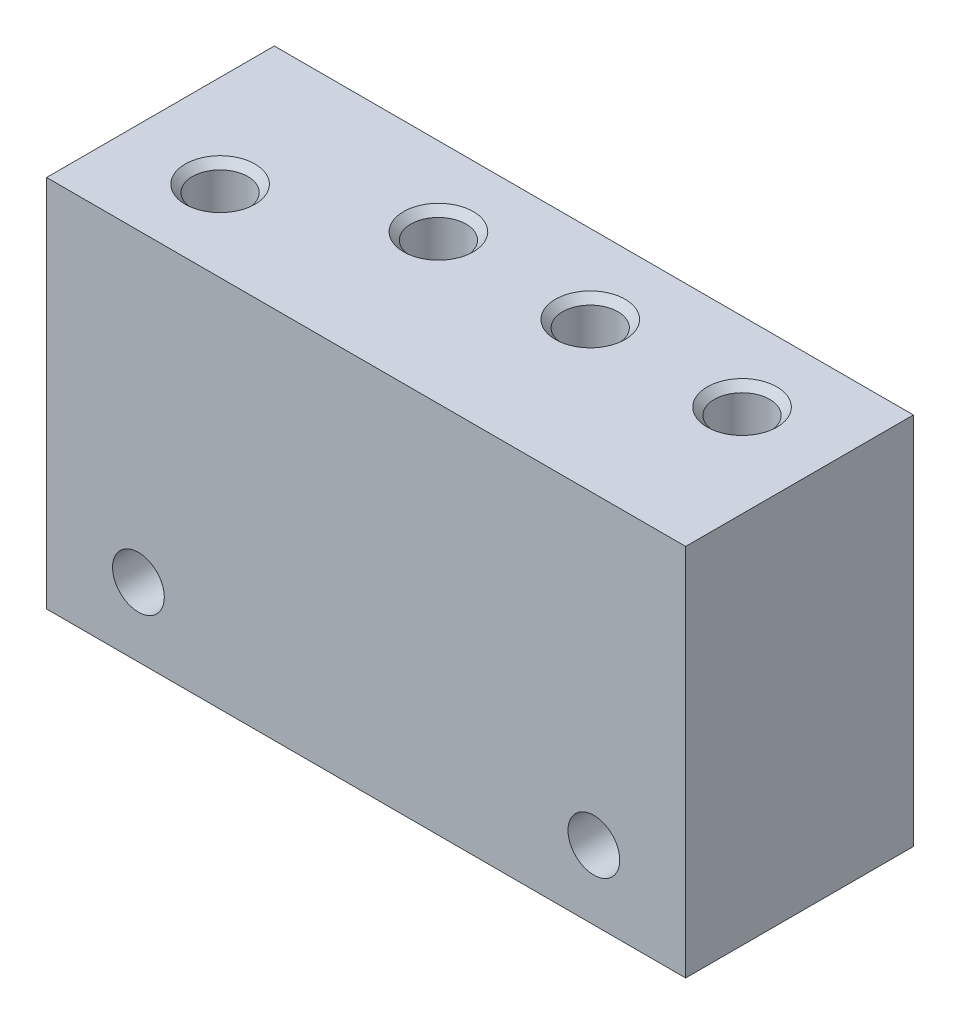
ISO-10303-21;
HEADER;
FILE_DESCRIPTION(('STEP AP214'),'2;1');
FILE_NAME('part.step','',(''),(''),'','','');
FILE_SCHEMA(('AUTOMOTIVE_DESIGN { 1 0 10303 214 1 1 1 1 }'));
ENDSEC;
DATA;
#1=APPLICATION_CONTEXT('core data for automotive mechanical design processes');
#2=APPLICATION_PROTOCOL_DEFINITION('international standard','automotive_design',2000,#1);
#3=PRODUCT_CONTEXT('',#1,'mechanical');
#4=PRODUCT('Part','Part','',(#3));
#5=PRODUCT_RELATED_PRODUCT_CATEGORY('part','',(#4));
#6=PRODUCT_DEFINITION_FORMATION('','',#4);
#7=PRODUCT_DEFINITION_CONTEXT('part definition',#1,'design');
#8=PRODUCT_DEFINITION('design','',#6,#7);
#9=PRODUCT_DEFINITION_SHAPE('','',#8);
#10=(LENGTH_UNIT() NAMED_UNIT(*) SI_UNIT(.MILLI.,.METRE.));
#11=(NAMED_UNIT(*) PLANE_ANGLE_UNIT() SI_UNIT($,.RADIAN.));
#12=(NAMED_UNIT(*) SI_UNIT($,.STERADIAN.) SOLID_ANGLE_UNIT());
#13=UNCERTAINTY_MEASURE_WITH_UNIT(LENGTH_MEASURE(1.E-05),#10,'distance_accuracy_value','');
#14=(GEOMETRIC_REPRESENTATION_CONTEXT(3) GLOBAL_UNCERTAINTY_ASSIGNED_CONTEXT((#13)) GLOBAL_UNIT_ASSIGNED_CONTEXT((#10,
#11,#12)) REPRESENTATION_CONTEXT('',''));
#15=CARTESIAN_POINT('',(0.,0.,0.));
#16=DIRECTION('',(0.,0.,1.));
#17=DIRECTION('',(1.,0.,0.));
#18=AXIS2_PLACEMENT_3D('',#15,#16,#17);
#19=CARTESIAN_POINT('',(22.1,12.925,0.));
#20=DIRECTION('',(0.,0.,-1.));
#21=DIRECTION('',(-1.,0.,0.));
#22=AXIS2_PLACEMENT_3D('',#19,#20,#21);
#23=PLANE('',#22);
#24=CARTESIAN_POINT('',(24.,17.646,0.));
#25=DIRECTION('',(0.,0.,-1.));
#26=DIRECTION('',(-1.,0.,0.));
#27=AXIS2_PLACEMENT_3D('',#24,#25,#26);
#28=CIRCLE('',#27,0.85);
#29=CARTESIAN_POINT('',(23.15,17.646,0.));
#30=VERTEX_POINT('',#29);
#31=EDGE_CURVE('E726',#30,#30,#28,.T.);
#32=ORIENTED_EDGE('',*,*,#31,.F.);
#33=EDGE_LOOP('',(#32));
#34=FACE_BOUND('',#33,.T.);
#35=CARTESIAN_POINT('',(27.3,14.246,0.));
#36=DIRECTION('',(0.,0.,-1.));
#37=DIRECTION('',(-1.,0.,0.));
#38=AXIS2_PLACEMENT_3D('',#35,#36,#37);
#39=CIRCLE('',#38,0.6);
#40=CARTESIAN_POINT('',(26.7,14.246,0.));
#41=VERTEX_POINT('',#40);
#42=EDGE_CURVE('E19',#41,#41,#39,.T.);
#43=ORIENTED_EDGE('',*,*,#42,.F.);
#44=EDGE_LOOP('',(#43));
#45=FACE_BOUND('',#44,.T.);
#46=CARTESIAN_POINT('',(27.3,19.646,0.));
#47=DIRECTION('',(0.,0.,-1.));
#48=DIRECTION('',(-1.,0.,0.));
#49=AXIS2_PLACEMENT_3D('',#46,#47,#48);
#50=CIRCLE('',#49,0.6);
#51=CARTESIAN_POINT('',(26.7,19.646,0.));
#52=VERTEX_POINT('',#51);
#53=EDGE_CURVE('E142',#52,#52,#50,.T.);
#54=ORIENTED_EDGE('',*,*,#53,.F.);
#55=EDGE_LOOP('',(#54));
#56=FACE_BOUND('',#55,.T.);
#57=CARTESIAN_POINT('',(27.3,16.946,0.));
#58=DIRECTION('',(0.,0.,-1.));
#59=DIRECTION('',(-1.,0.,0.));
#60=AXIS2_PLACEMENT_3D('',#57,#58,#59);
#61=CIRCLE('',#60,0.6);
#62=CARTESIAN_POINT('',(26.7,16.946,0.));
#63=VERTEX_POINT('',#62);
#64=EDGE_CURVE('E139',#63,#63,#61,.T.);
#65=ORIENTED_EDGE('',*,*,#64,.F.);
#66=EDGE_LOOP('',(#65));
#67=FACE_BOUND('',#66,.T.);
#68=CARTESIAN_POINT('',(13.5,17.646,0.));
#69=DIRECTION('',(0.,0.,-1.));
#70=DIRECTION('',(-1.,0.,0.));
#71=AXIS2_PLACEMENT_3D('',#68,#69,#70);
#72=CIRCLE('',#71,0.85);
#73=CARTESIAN_POINT('',(12.65,17.646,0.));
#74=VERTEX_POINT('',#73);
#75=EDGE_CURVE('E174',#74,#74,#72,.T.);
#76=ORIENTED_EDGE('',*,*,#75,.F.);
#77=EDGE_LOOP('',(#76));
#78=FACE_BOUND('',#77,.T.);
#79=CARTESIAN_POINT('',(16.8,14.246,0.));
#80=DIRECTION('',(0.,0.,-1.));
#81=DIRECTION('',(-1.,0.,0.));
#82=AXIS2_PLACEMENT_3D('',#79,#80,#81);
#83=CIRCLE('',#82,0.6);
#84=CARTESIAN_POINT('',(16.2,14.246,0.));
#85=VERTEX_POINT('',#84);
#86=EDGE_CURVE('E134',#85,#85,#83,.T.);
#87=ORIENTED_EDGE('',*,*,#86,.F.);
#88=EDGE_LOOP('',(#87));
#89=FACE_BOUND('',#88,.T.);
#90=CARTESIAN_POINT('',(16.8,19.646,0.));
#91=DIRECTION('',(0.,0.,-1.));
#92=DIRECTION('',(-1.,0.,0.));
#93=AXIS2_PLACEMENT_3D('',#90,#91,#92);
#94=CIRCLE('',#93,0.6);
#95=CARTESIAN_POINT('',(16.2,19.646,0.));
#96=VERTEX_POINT('',#95);
#97=EDGE_CURVE('E129',#96,#96,#94,.T.);
#98=ORIENTED_EDGE('',*,*,#97,.F.);
#99=EDGE_LOOP('',(#98));
#100=FACE_BOUND('',#99,.T.);
#101=CARTESIAN_POINT('',(16.8,16.946,0.));
#102=DIRECTION('',(0.,0.,-1.));
#103=DIRECTION('',(-1.,0.,0.));
#104=AXIS2_PLACEMENT_3D('',#101,#102,#103);
#105=CIRCLE('',#104,0.6);
#106=CARTESIAN_POINT('',(16.2,16.946,0.));
#107=VERTEX_POINT('',#106);
#108=EDGE_CURVE('E125',#107,#107,#105,.T.);
#109=ORIENTED_EDGE('',*,*,#108,.F.);
#110=EDGE_LOOP('',(#109));
#111=FACE_BOUND('',#110,.T.);
#112=CARTESIAN_POINT('',(37.85,4.78,0.));
#113=DIRECTION('',(0.,0.,-1.));
#114=DIRECTION('',(-1.,0.,0.));
#115=AXIS2_PLACEMENT_3D('',#112,#113,#114);
#116=CIRCLE('',#115,2.975);
#117=CARTESIAN_POINT('',(34.875,4.78,0.));
#118=VERTEX_POINT('',#117);
#119=EDGE_CURVE('E115',#118,#118,#116,.T.);
#120=ORIENTED_EDGE('',*,*,#119,.F.);
#121=EDGE_LOOP('',(#120));
#122=FACE_BOUND('',#121,.T.);
#123=CARTESIAN_POINT('',(6.35,4.78,0.));
#124=DIRECTION('',(0.,0.,-1.));
#125=DIRECTION('',(-1.,0.,0.));
#126=AXIS2_PLACEMENT_3D('',#123,#124,#125);
#127=CIRCLE('',#126,2.975);
#128=CARTESIAN_POINT('',(3.375,4.78,0.));
#129=VERTEX_POINT('',#128);
#130=EDGE_CURVE('E108',#129,#129,#127,.T.);
#131=ORIENTED_EDGE('',*,*,#130,.F.);
#132=EDGE_LOOP('',(#131));
#133=FACE_BOUND('',#132,.T.);
#134=DIRECTION('',(0.,1.,0.));
#135=VECTOR('',#134,1.);
#136=CARTESIAN_POINT('',(44.2,12.925,0.));
#137=LINE('',#136,#135);
#138=CARTESIAN_POINT('',(44.2,0.,0.));
#139=VERTEX_POINT('',#138);
#140=CARTESIAN_POINT('',(44.2,25.85,0.));
#141=VERTEX_POINT('',#140);
#142=EDGE_CURVE('E61',#139,#141,#137,.T.);
#143=ORIENTED_EDGE('',*,*,#142,.F.);
#144=DIRECTION('',(1.,0.,0.));
#145=VECTOR('',#144,1.);
#146=CARTESIAN_POINT('',(22.1,0.,0.));
#147=LINE('',#146,#145);
#148=CARTESIAN_POINT('',(0.,0.,0.));
#149=VERTEX_POINT('',#148);
#150=EDGE_CURVE('E68',#149,#139,#147,.T.);
#151=ORIENTED_EDGE('',*,*,#150,.F.);
#152=DIRECTION('',(0.,-1.,0.));
#153=VECTOR('',#152,1.);
#154=CARTESIAN_POINT('',(0.,12.925,0.));
#155=LINE('',#154,#153);
#156=CARTESIAN_POINT('',(0.,25.85,0.));
#157=VERTEX_POINT('',#156);
#158=EDGE_CURVE('E75',#157,#149,#155,.T.);
#159=ORIENTED_EDGE('',*,*,#158,.F.);
#160=DIRECTION('',(-1.,0.,0.));
#161=VECTOR('',#160,1.);
#162=CARTESIAN_POINT('',(22.1,25.85,0.));
#163=LINE('',#162,#161);
#164=EDGE_CURVE('E81',#141,#157,#163,.T.);
#165=ORIENTED_EDGE('',*,*,#164,.F.);
#166=EDGE_LOOP('',(#143,#151,#159,#165));
#167=FACE_BOUND('',#166,.T.);
#168=CARTESIAN_POINT('',(20.1,17.646,0.));
#169=DIRECTION('',(0.,0.,-1.));
#170=DIRECTION('',(-1.,0.,0.));
#171=AXIS2_PLACEMENT_3D('',#168,#169,#170);
#172=CIRCLE('',#171,0.85);
#173=CARTESIAN_POINT('',(19.25,17.646,0.));
#174=VERTEX_POINT('',#173);
#175=EDGE_CURVE('E151',#174,#174,#172,.T.);
#176=ORIENTED_EDGE('',*,*,#175,.F.);
#177=EDGE_LOOP('',(#176));
#178=FACE_BOUND('',#177,.T.);
#179=CARTESIAN_POINT('',(30.6,17.646,0.));
#180=DIRECTION('',(0.,0.,-1.));
#181=DIRECTION('',(-1.,0.,0.));
#182=AXIS2_PLACEMENT_3D('',#179,#180,#181);
#183=CIRCLE('',#182,0.85);
#184=CARTESIAN_POINT('',(29.75,17.646,0.));
#185=VERTEX_POINT('',#184);
#186=EDGE_CURVE('E720',#185,#185,#183,.T.);
#187=ORIENTED_EDGE('',*,*,#186,.F.);
#188=EDGE_LOOP('',(#187));
#189=FACE_BOUND('',#188,.T.);
#190=ADVANCED_FACE('F15',(#34,#45,#56,#67,#78,#89,#100,#111,#122,#133,#167,#178,#189),#23,.T.);
#191=CARTESIAN_POINT('',(22.1,25.85,0.));
#192=DIRECTION('',(0.,1.,0.));
#193=DIRECTION('',(0.,0.,1.));
#194=AXIS2_PLACEMENT_3D('',#191,#192,#193);
#195=PLANE('',#194);
#196=CARTESIAN_POINT('',(16.8,25.85,5.45));
#197=DIRECTION('',(0.,1.,0.));
#198=DIRECTION('',(0.,0.,1.));
#199=AXIS2_PLACEMENT_3D('',#196,#197,#198);
#200=CIRCLE('',#199,2.413);
#201=CARTESIAN_POINT('',(16.8,25.85,7.863));
#202=VERTEX_POINT('',#201);
#203=EDGE_CURVE('E208',#202,#202,#200,.T.);
#204=ORIENTED_EDGE('',*,*,#203,.F.);
#205=EDGE_LOOP('',(#204));
#206=FACE_BOUND('',#205,.T.);
#207=CARTESIAN_POINT('',(37.8,25.85,5.45));
#208=DIRECTION('',(0.,1.,0.));
#209=DIRECTION('',(0.,0.,1.));
#210=AXIS2_PLACEMENT_3D('',#207,#208,#209);
#211=CIRCLE('',#210,2.413);
#212=CARTESIAN_POINT('',(37.8,25.85,7.863));
#213=VERTEX_POINT('',#212);
#214=EDGE_CURVE('E232',#213,#213,#211,.T.);
#215=ORIENTED_EDGE('',*,*,#214,.F.);
#216=EDGE_LOOP('',(#215));
#217=FACE_BOUND('',#216,.T.);
#218=DIRECTION('',(0.,0.,1.));
#219=VECTOR('',#218,1.);
#220=CARTESIAN_POINT('',(0.,25.85,0.));
#221=LINE('',#220,#219);
#222=CARTESIAN_POINT('',(0.,25.85,15.75));
#223=VERTEX_POINT('',#222);
#224=EDGE_CURVE('E95',#157,#223,#221,.T.);
#225=ORIENTED_EDGE('',*,*,#224,.T.);
#226=DIRECTION('',(1.,0.,0.));
#227=VECTOR('',#226,1.);
#228=CARTESIAN_POINT('',(22.1,25.85,15.75));
#229=LINE('',#228,#227);
#230=CARTESIAN_POINT('',(44.2,25.85,15.75));
#231=VERTEX_POINT('',#230);
#232=EDGE_CURVE('E103',#223,#231,#229,.T.);
#233=ORIENTED_EDGE('',*,*,#232,.T.);
#234=DIRECTION('',(0.,0.,1.));
#235=VECTOR('',#234,1.);
#236=CARTESIAN_POINT('',(44.2,25.85,0.));
#237=LINE('',#236,#235);
#238=EDGE_CURVE('E65',#141,#231,#237,.T.);
#239=ORIENTED_EDGE('',*,*,#238,.F.);
#240=ORIENTED_EDGE('',*,*,#164,.T.);
#241=EDGE_LOOP('',(#225,#233,#239,#240));
#242=FACE_BOUND('',#241,.T.);
#243=CARTESIAN_POINT('',(6.4,25.85,10.15));
#244=DIRECTION('',(0.,1.,0.));
#245=DIRECTION('',(0.,0.,1.));
#246=AXIS2_PLACEMENT_3D('',#243,#244,#245);
#247=CIRCLE('',#246,2.413);
#248=CARTESIAN_POINT('',(6.4,25.85,12.563));
#249=VERTEX_POINT('',#248);
#250=EDGE_CURVE('E220',#249,#249,#247,.T.);
#251=ORIENTED_EDGE('',*,*,#250,.F.);
#252=EDGE_LOOP('',(#251));
#253=FACE_BOUND('',#252,.T.);
#254=CARTESIAN_POINT('',(27.3,25.85,5.45));
#255=DIRECTION('',(0.,1.,0.));
#256=DIRECTION('',(0.,0.,1.));
#257=AXIS2_PLACEMENT_3D('',#254,#255,#256);
#258=CIRCLE('',#257,2.413);
#259=CARTESIAN_POINT('',(27.3,25.85,7.863));
#260=VERTEX_POINT('',#259);
#261=EDGE_CURVE('E138',#260,#260,#258,.T.);
#262=ORIENTED_EDGE('',*,*,#261,.F.);
#263=EDGE_LOOP('',(#262));
#264=FACE_BOUND('',#263,.T.);
#265=ADVANCED_FACE('F279',(#206,#217,#242,#253,#264),#195,.T.);
#266=CARTESIAN_POINT('',(22.1,12.925,15.75));
#267=DIRECTION('',(0.,0.,1.));
#268=DIRECTION('',(1.,0.,0.));
#269=AXIS2_PLACEMENT_3D('',#266,#267,#268);
#270=PLANE('',#269);
#271=CARTESIAN_POINT('',(37.85,4.78,15.75));
#272=DIRECTION('',(0.,0.,1.));
#273=DIRECTION('',(1.,0.,0.));
#274=AXIS2_PLACEMENT_3D('',#271,#272,#273);
#275=CIRCLE('',#274,1.79);
#276=CARTESIAN_POINT('',(39.64,4.78,15.75));
#277=VERTEX_POINT('',#276);
#278=EDGE_CURVE('E119',#277,#277,#275,.T.);
#279=ORIENTED_EDGE('',*,*,#278,.F.);
#280=EDGE_LOOP('',(#279));
#281=FACE_BOUND('',#280,.T.);
#282=CARTESIAN_POINT('',(6.35,4.78,15.75));
#283=DIRECTION('',(0.,0.,1.));
#284=DIRECTION('',(1.,0.,0.));
#285=AXIS2_PLACEMENT_3D('',#282,#283,#284);
#286=CIRCLE('',#285,1.79);
#287=CARTESIAN_POINT('',(8.14,4.78,15.75));
#288=VERTEX_POINT('',#287);
#289=EDGE_CURVE('E76',#288,#288,#286,.T.);
#290=ORIENTED_EDGE('',*,*,#289,.F.);
#291=EDGE_LOOP('',(#290));
#292=FACE_BOUND('',#291,.T.);
#293=DIRECTION('',(-1.,0.,0.));
#294=VECTOR('',#293,1.);
#295=CARTESIAN_POINT('',(22.1,0.,15.75));
#296=LINE('',#295,#294);
#297=CARTESIAN_POINT('',(44.2,0.,15.75));
#298=VERTEX_POINT('',#297);
#299=CARTESIAN_POINT('',(0.,0.,15.75));
#300=VERTEX_POINT('',#299);
#301=EDGE_CURVE('E10',#298,#300,#296,.T.);
#302=ORIENTED_EDGE('',*,*,#301,.F.);
#303=DIRECTION('',(0.,-1.,0.));
#304=VECTOR('',#303,1.);
#305=CARTESIAN_POINT('',(44.2,12.925,15.75));
#306=LINE('',#305,#304);
#307=EDGE_CURVE('E63',#231,#298,#306,.T.);
#308=ORIENTED_EDGE('',*,*,#307,.F.);
#309=ORIENTED_EDGE('',*,*,#232,.F.);
#310=DIRECTION('',(0.,1.,0.));
#311=VECTOR('',#310,1.);
#312=CARTESIAN_POINT('',(0.,12.925,15.75));
#313=LINE('',#312,#311);
#314=EDGE_CURVE('E25',#300,#223,#313,.T.);
#315=ORIENTED_EDGE('',*,*,#314,.F.);
#316=EDGE_LOOP('',(#302,#308,#309,#315));
#317=FACE_BOUND('',#316,.T.);
#318=ADVANCED_FACE('F17',(#281,#292,#317),#270,.T.);
#319=CARTESIAN_POINT('',(22.1,0.,0.));
#320=DIRECTION('',(0.,-1.,0.));
#321=DIRECTION('',(0.,0.,-1.));
#322=AXIS2_PLACEMENT_3D('',#319,#320,#321);
#323=PLANE('',#322);
#324=DIRECTION('',(0.,0.,1.));
#325=VECTOR('',#324,1.);
#326=CARTESIAN_POINT('',(44.2,0.,0.));
#327=LINE('',#326,#325);
#328=EDGE_CURVE('E56',#139,#298,#327,.T.);
#329=ORIENTED_EDGE('',*,*,#328,.T.);
#330=ORIENTED_EDGE('',*,*,#301,.T.);
#331=DIRECTION('',(0.,0.,1.));
#332=VECTOR('',#331,1.);
#333=CARTESIAN_POINT('',(0.,0.,0.));
#334=LINE('',#333,#332);
#335=EDGE_CURVE('E70',#149,#300,#334,.T.);
#336=ORIENTED_EDGE('',*,*,#335,.F.);
#337=ORIENTED_EDGE('',*,*,#150,.T.);
#338=EDGE_LOOP('',(#329,#330,#336,#337));
#339=FACE_BOUND('',#338,.T.);
#340=ADVANCED_FACE('F69',(#339),#323,.T.);
#341=CARTESIAN_POINT('',(0.,12.925,0.));
#342=DIRECTION('',(-1.,0.,0.));
#343=DIRECTION('',(0.,0.,1.));
#344=AXIS2_PLACEMENT_3D('',#341,#342,#343);
#345=PLANE('',#344);
#346=ORIENTED_EDGE('',*,*,#335,.T.);
#347=ORIENTED_EDGE('',*,*,#314,.T.);
#348=ORIENTED_EDGE('',*,*,#224,.F.);
#349=ORIENTED_EDGE('',*,*,#158,.T.);
#350=EDGE_LOOP('',(#346,#347,#348,#349));
#351=FACE_BOUND('',#350,.T.);
#352=ADVANCED_FACE('F291',(#351),#345,.T.);
#353=CARTESIAN_POINT('',(44.2,12.925,0.));
#354=DIRECTION('',(1.,0.,0.));
#355=DIRECTION('',(0.,0.,-1.));
#356=AXIS2_PLACEMENT_3D('',#353,#354,#355);
#357=PLANE('',#356);
#358=ORIENTED_EDGE('',*,*,#142,.T.);
#359=ORIENTED_EDGE('',*,*,#238,.T.);
#360=ORIENTED_EDGE('',*,*,#307,.T.);
#361=ORIENTED_EDGE('',*,*,#328,.F.);
#362=EDGE_LOOP('',(#358,#359,#360,#361));
#363=FACE_BOUND('',#362,.T.);
#364=ADVANCED_FACE('F58',(#363),#357,.T.);
#365=CARTESIAN_POINT('',(6.35,4.78,4.26));
#366=DIRECTION('',(0.,0.,1.));
#367=DIRECTION('',(1.,0.,0.));
#368=AXIS2_PLACEMENT_3D('',#365,#366,#367);
#369=PLANE('',#368);
#370=CARTESIAN_POINT('',(6.35,4.78,4.26));
#371=DIRECTION('',(0.,0.,1.));
#372=DIRECTION('',(1.,0.,0.));
#373=AXIS2_PLACEMENT_3D('',#370,#371,#372);
#374=CIRCLE('',#373,1.79);
#375=CARTESIAN_POINT('',(8.14,4.78,4.26));
#376=VERTEX_POINT('',#375);
#377=EDGE_CURVE('E111',#376,#376,#374,.F.);
#378=ORIENTED_EDGE('',*,*,#377,.F.);
#379=EDGE_LOOP('',(#378));
#380=FACE_BOUND('',#379,.T.);
#381=CARTESIAN_POINT('',(6.35,4.78,4.26));
#382=DIRECTION('',(0.,0.,-1.));
#383=DIRECTION('',(0.,-1.,0.));
#384=AXIS2_PLACEMENT_3D('',#381,#382,#383);
#385=CIRCLE('',#384,2.975);
#386=CARTESIAN_POINT('',(6.35,1.805,4.26));
#387=VERTEX_POINT('',#386);
#388=EDGE_CURVE('E124',#387,#387,#385,.T.);
#389=ORIENTED_EDGE('',*,*,#388,.T.);
#390=EDGE_LOOP('',(#389));
#391=FACE_BOUND('',#390,.T.);
#392=ADVANCED_FACE('F261',(#380,#391),#369,.F.);
#393=CARTESIAN_POINT('',(6.35,4.78,4.26));
#394=DIRECTION('',(0.,0.,-1.));
#395=DIRECTION('',(0.,-1.,0.));
#396=AXIS2_PLACEMENT_3D('',#393,#394,#395);
#397=CYLINDRICAL_SURFACE('',#396,2.975);
#398=ORIENTED_EDGE('',*,*,#130,.T.);
#399=EDGE_LOOP('',(#398));
#400=FACE_BOUND('',#399,.T.);
#401=ORIENTED_EDGE('',*,*,#388,.F.);
#402=EDGE_LOOP('',(#401));
#403=FACE_BOUND('',#402,.T.);
#404=ADVANCED_FACE('F264',(#400,#403),#397,.F.);
#405=CARTESIAN_POINT('',(6.35,4.78,-2.));
#406=DIRECTION('',(0.,0.,1.));
#407=DIRECTION('',(0.,1.,0.));
#408=AXIS2_PLACEMENT_3D('',#405,#406,#407);
#409=CYLINDRICAL_SURFACE('',#408,1.79);
#410=ORIENTED_EDGE('',*,*,#289,.T.);
#411=EDGE_LOOP('',(#410));
#412=FACE_BOUND('',#411,.T.);
#413=ORIENTED_EDGE('',*,*,#377,.T.);
#414=EDGE_LOOP('',(#413));
#415=FACE_BOUND('',#414,.T.);
#416=ADVANCED_FACE('F259',(#412,#415),#409,.F.);
#417=CARTESIAN_POINT('',(37.85,4.78,4.26));
#418=DIRECTION('',(0.,0.,1.));
#419=DIRECTION('',(1.,0.,0.));
#420=AXIS2_PLACEMENT_3D('',#417,#418,#419);
#421=PLANE('',#420);
#422=CARTESIAN_POINT('',(37.85,4.78,4.26));
#423=DIRECTION('',(0.,0.,1.));
#424=DIRECTION('',(1.,0.,0.));
#425=AXIS2_PLACEMENT_3D('',#422,#423,#424);
#426=CIRCLE('',#425,1.79);
#427=CARTESIAN_POINT('',(39.64,4.78,4.26));
#428=VERTEX_POINT('',#427);
#429=EDGE_CURVE('E120',#428,#428,#426,.F.);
#430=ORIENTED_EDGE('',*,*,#429,.F.);
#431=EDGE_LOOP('',(#430));
#432=FACE_BOUND('',#431,.T.);
#433=CARTESIAN_POINT('',(37.85,4.78,4.26));
#434=DIRECTION('',(0.,0.,-1.));
#435=DIRECTION('',(0.,-1.,0.));
#436=AXIS2_PLACEMENT_3D('',#433,#434,#435);
#437=CIRCLE('',#436,2.975);
#438=CARTESIAN_POINT('',(37.85,1.805,4.26));
#439=VERTEX_POINT('',#438);
#440=EDGE_CURVE('E244',#439,#439,#437,.T.);
#441=ORIENTED_EDGE('',*,*,#440,.T.);
#442=EDGE_LOOP('',(#441));
#443=FACE_BOUND('',#442,.T.);
#444=ADVANCED_FACE('F275',(#432,#443),#421,.F.);
#445=CARTESIAN_POINT('',(37.85,4.78,4.26));
#446=DIRECTION('',(0.,0.,-1.));
#447=DIRECTION('',(0.,-1.,0.));
#448=AXIS2_PLACEMENT_3D('',#445,#446,#447);
#449=CYLINDRICAL_SURFACE('',#448,2.975);
#450=ORIENTED_EDGE('',*,*,#119,.T.);
#451=EDGE_LOOP('',(#450));
#452=FACE_BOUND('',#451,.T.);
#453=ORIENTED_EDGE('',*,*,#440,.F.);
#454=EDGE_LOOP('',(#453));
#455=FACE_BOUND('',#454,.T.);
#456=ADVANCED_FACE('F369',(#452,#455),#449,.F.);
#457=CARTESIAN_POINT('',(37.85,4.78,-2.));
#458=DIRECTION('',(0.,0.,1.));
#459=DIRECTION('',(0.,1.,0.));
#460=AXIS2_PLACEMENT_3D('',#457,#458,#459);
#461=CYLINDRICAL_SURFACE('',#460,1.79);
#462=ORIENTED_EDGE('',*,*,#278,.T.);
#463=EDGE_LOOP('',(#462));
#464=FACE_BOUND('',#463,.T.);
#465=ORIENTED_EDGE('',*,*,#429,.T.);
#466=EDGE_LOOP('',(#465));
#467=FACE_BOUND('',#466,.T.);
#468=ADVANCED_FACE('F365',(#464,#467),#461,.F.);
#469=CARTESIAN_POINT('',(37.8,10.85,5.45));
#470=DIRECTION('',(0.,1.,0.));
#471=DIRECTION('',(0.,0.,1.));
#472=AXIS2_PLACEMENT_3D('',#469,#470,#471);
#473=PLANE('',#472);
#474=CARTESIAN_POINT('',(37.8,10.85,5.45));
#475=DIRECTION('',(0.,1.,0.));
#476=DIRECTION('',(0.,0.,1.));
#477=AXIS2_PLACEMENT_3D('',#474,#475,#476);
#478=CIRCLE('',#477,1.915);
#479=CARTESIAN_POINT('',(37.8,10.85,7.365));
#480=VERTEX_POINT('',#479);
#481=EDGE_CURVE('E240',#480,#480,#478,.T.);
#482=ORIENTED_EDGE('',*,*,#481,.T.);
#483=EDGE_LOOP('',(#482));
#484=FACE_BOUND('',#483,.T.);
#485=ADVANCED_FACE('F361',(#484),#473,.T.);
#486=CARTESIAN_POINT('',(37.8,26.85,5.45));
#487=DIRECTION('',(0.,1.,0.));
#488=DIRECTION('',(0.,0.,1.));
#489=AXIS2_PLACEMENT_3D('',#486,#487,#488);
#490=CYLINDRICAL_SURFACE('',#489,1.915);
#491=CARTESIAN_POINT('',(37.8,25.352,5.45));
#492=DIRECTION('',(0.,1.,0.));
#493=DIRECTION('',(0.,0.,1.));
#494=AXIS2_PLACEMENT_3D('',#491,#492,#493);
#495=CIRCLE('',#494,1.915);
#496=CARTESIAN_POINT('',(37.8,25.352,7.365));
#497=VERTEX_POINT('',#496);
#498=EDGE_CURVE('E236',#497,#497,#495,.T.);
#499=ORIENTED_EDGE('',*,*,#498,.T.);
#500=EDGE_LOOP('',(#499));
#501=FACE_BOUND('',#500,.T.);
#502=ORIENTED_EDGE('',*,*,#481,.F.);
#503=EDGE_LOOP('',(#502));
#504=FACE_BOUND('',#503,.T.);
#505=ADVANCED_FACE('F357',(#501,#504),#490,.F.);
#506=CARTESIAN_POINT('',(37.8,25.352,5.45));
#507=DIRECTION('',(0.,1.,0.));
#508=DIRECTION('',(0.,0.,1.));
#509=AXIS2_PLACEMENT_3D('',#506,#507,#508);
#510=CONICAL_SURFACE('',#509,1.915,0.785398163397449);
#511=ORIENTED_EDGE('',*,*,#214,.T.);
#512=EDGE_LOOP('',(#511));
#513=FACE_BOUND('',#512,.T.);
#514=ORIENTED_EDGE('',*,*,#498,.F.);
#515=EDGE_LOOP('',(#514));
#516=FACE_BOUND('',#515,.T.);
#517=ADVANCED_FACE('F353',(#513,#516),#510,.F.);
#518=CARTESIAN_POINT('',(6.4,15.85,10.15));
#519=DIRECTION('',(0.,1.,0.));
#520=DIRECTION('',(0.,0.,1.));
#521=AXIS2_PLACEMENT_3D('',#518,#519,#520);
#522=PLANE('',#521);
#523=CARTESIAN_POINT('',(6.4,15.85,10.15));
#524=DIRECTION('',(0.,1.,0.));
#525=DIRECTION('',(0.,0.,1.));
#526=AXIS2_PLACEMENT_3D('',#523,#524,#525);
#527=CIRCLE('',#526,1.915);
#528=CARTESIAN_POINT('',(6.4,15.85,12.065));
#529=VERTEX_POINT('',#528);
#530=EDGE_CURVE('E228',#529,#529,#527,.T.);
#531=ORIENTED_EDGE('',*,*,#530,.T.);
#532=EDGE_LOOP('',(#531));
#533=FACE_BOUND('',#532,.T.);
#534=ADVANCED_FACE('F349',(#533),#522,.T.);
#535=CARTESIAN_POINT('',(6.4,26.85,10.15));
#536=DIRECTION('',(0.,1.,0.));
#537=DIRECTION('',(0.,0.,1.));
#538=AXIS2_PLACEMENT_3D('',#535,#536,#537);
#539=CYLINDRICAL_SURFACE('',#538,1.915);
#540=CARTESIAN_POINT('',(6.4,25.352,10.15));
#541=DIRECTION('',(0.,1.,0.));
#542=DIRECTION('',(0.,0.,1.));
#543=AXIS2_PLACEMENT_3D('',#540,#541,#542);
#544=CIRCLE('',#543,1.915);
#545=CARTESIAN_POINT('',(6.4,25.352,12.065));
#546=VERTEX_POINT('',#545);
#547=EDGE_CURVE('E224',#546,#546,#544,.T.);
#548=ORIENTED_EDGE('',*,*,#547,.T.);
#549=EDGE_LOOP('',(#548));
#550=FACE_BOUND('',#549,.T.);
#551=ORIENTED_EDGE('',*,*,#530,.F.);
#552=EDGE_LOOP('',(#551));
#553=FACE_BOUND('',#552,.T.);
#554=ADVANCED_FACE('F345',(#550,#553),#539,.F.);
#555=CARTESIAN_POINT('',(6.4,25.352,10.15));
#556=DIRECTION('',(0.,1.,0.));
#557=DIRECTION('',(0.,0.,1.));
#558=AXIS2_PLACEMENT_3D('',#555,#556,#557);
#559=CONICAL_SURFACE('',#558,1.915,0.785398163397449);
#560=ORIENTED_EDGE('',*,*,#250,.T.);
#561=EDGE_LOOP('',(#560));
#562=FACE_BOUND('',#561,.T.);
#563=ORIENTED_EDGE('',*,*,#547,.F.);
#564=EDGE_LOOP('',(#563));
#565=FACE_BOUND('',#564,.T.);
#566=ADVANCED_FACE('F341',(#562,#565),#559,.F.);
#567=CARTESIAN_POINT('',(16.8,20.85,5.45));
#568=DIRECTION('',(0.,1.,0.));
#569=DIRECTION('',(0.,0.,1.));
#570=AXIS2_PLACEMENT_3D('',#567,#568,#569);
#571=PLANE('',#570);
#572=CARTESIAN_POINT('',(16.8,20.85,5.45));
#573=DIRECTION('',(0.,1.,0.));
#574=DIRECTION('',(0.,0.,1.));
#575=AXIS2_PLACEMENT_3D('',#572,#573,#574);
#576=CIRCLE('',#575,1.915);
#577=CARTESIAN_POINT('',(16.8,20.85,7.365));
#578=VERTEX_POINT('',#577);
#579=EDGE_CURVE('E216',#578,#578,#576,.T.);
#580=ORIENTED_EDGE('',*,*,#579,.T.);
#581=EDGE_LOOP('',(#580));
#582=FACE_BOUND('',#581,.T.);
#583=ADVANCED_FACE('F337',(#582),#571,.T.);
#584=CARTESIAN_POINT('',(16.8,26.85,5.45));
#585=DIRECTION('',(0.,1.,0.));
#586=DIRECTION('',(0.,0.,1.));
#587=AXIS2_PLACEMENT_3D('',#584,#585,#586);
#588=CYLINDRICAL_SURFACE('',#587,1.915);
#589=CARTESIAN_POINT('',(16.8,25.352,5.45));
#590=DIRECTION('',(0.,1.,0.));
#591=DIRECTION('',(0.,0.,1.));
#592=AXIS2_PLACEMENT_3D('',#589,#590,#591);
#593=CIRCLE('',#592,1.915);
#594=CARTESIAN_POINT('',(16.8,25.352,7.365));
#595=VERTEX_POINT('',#594);
#596=EDGE_CURVE('E212',#595,#595,#593,.T.);
#597=ORIENTED_EDGE('',*,*,#596,.T.);
#598=EDGE_LOOP('',(#597));
#599=FACE_BOUND('',#598,.T.);
#600=ORIENTED_EDGE('',*,*,#579,.F.);
#601=EDGE_LOOP('',(#600));
#602=FACE_BOUND('',#601,.T.);
#603=ADVANCED_FACE('F331',(#599,#602),#588,.F.);
#604=CARTESIAN_POINT('',(16.8,25.352,5.45));
#605=DIRECTION('',(0.,1.,0.));
#606=DIRECTION('',(0.,0.,1.));
#607=AXIS2_PLACEMENT_3D('',#604,#605,#606);
#608=CONICAL_SURFACE('',#607,1.915,0.785398163397448);
#609=ORIENTED_EDGE('',*,*,#203,.T.);
#610=EDGE_LOOP('',(#609));
#611=FACE_BOUND('',#610,.T.);
#612=ORIENTED_EDGE('',*,*,#596,.F.);
#613=EDGE_LOOP('',(#612));
#614=FACE_BOUND('',#613,.T.);
#615=ADVANCED_FACE('F326',(#611,#614),#608,.F.);
#616=CARTESIAN_POINT('',(27.3,20.85,5.45));
#617=DIRECTION('',(0.,1.,0.));
#618=DIRECTION('',(0.,0.,1.));
#619=AXIS2_PLACEMENT_3D('',#616,#617,#618);
#620=PLANE('',#619);
#621=CARTESIAN_POINT('',(27.3,20.85,5.45));
#622=DIRECTION('',(0.,1.,0.));
#623=DIRECTION('',(0.,0.,1.));
#624=AXIS2_PLACEMENT_3D('',#621,#622,#623);
#625=CIRCLE('',#624,1.915);
#626=CARTESIAN_POINT('',(27.3,20.85,7.365));
#627=VERTEX_POINT('',#626);
#628=EDGE_CURVE('E204',#627,#627,#625,.T.);
#629=ORIENTED_EDGE('',*,*,#628,.T.);
#630=EDGE_LOOP('',(#629));
#631=FACE_BOUND('',#630,.T.);
#632=ADVANCED_FACE('F321',(#631),#620,.T.);
#633=CARTESIAN_POINT('',(27.3,26.85,5.45));
#634=DIRECTION('',(0.,1.,0.));
#635=DIRECTION('',(0.,0.,1.));
#636=AXIS2_PLACEMENT_3D('',#633,#634,#635);
#637=CYLINDRICAL_SURFACE('',#636,1.915);
#638=CARTESIAN_POINT('',(27.3,25.352,5.45));
#639=DIRECTION('',(0.,1.,0.));
#640=DIRECTION('',(0.,0.,1.));
#641=AXIS2_PLACEMENT_3D('',#638,#639,#640);
#642=CIRCLE('',#641,1.915);
#643=CARTESIAN_POINT('',(27.3,25.352,7.365));
#644=VERTEX_POINT('',#643);
#645=EDGE_CURVE('E200',#644,#644,#642,.T.);
#646=ORIENTED_EDGE('',*,*,#645,.T.);
#647=EDGE_LOOP('',(#646));
#648=FACE_BOUND('',#647,.T.);
#649=ORIENTED_EDGE('',*,*,#628,.F.);
#650=EDGE_LOOP('',(#649));
#651=FACE_BOUND('',#650,.T.);
#652=ADVANCED_FACE('F315',(#648,#651),#637,.F.);
#653=CARTESIAN_POINT('',(27.3,25.352,5.45));
#654=DIRECTION('',(0.,1.,0.));
#655=DIRECTION('',(0.,0.,1.));
#656=AXIS2_PLACEMENT_3D('',#653,#654,#655);
#657=CONICAL_SURFACE('',#656,1.915,0.785398163397448);
#658=ORIENTED_EDGE('',*,*,#261,.T.);
#659=EDGE_LOOP('',(#658));
#660=FACE_BOUND('',#659,.T.);
#661=ORIENTED_EDGE('',*,*,#645,.F.);
#662=EDGE_LOOP('',(#661));
#663=FACE_BOUND('',#662,.T.);
#664=ADVANCED_FACE('F311',(#660,#663),#657,.F.);
#665=CARTESIAN_POINT('',(16.8,16.946,5.));
#666=DIRECTION('',(0.,0.,1.));
#667=DIRECTION('',(1.,0.,0.));
#668=AXIS2_PLACEMENT_3D('',#665,#666,#667);
#669=PLANE('',#668);
#670=CARTESIAN_POINT('',(16.8,16.946,5.));
#671=DIRECTION('',(0.,0.,-1.));
#672=DIRECTION('',(0.,1.,0.));
#673=AXIS2_PLACEMENT_3D('',#670,#671,#672);
#674=CIRCLE('',#673,0.6);
#675=CARTESIAN_POINT('',(16.8,17.546,5.));
#676=VERTEX_POINT('',#675);
#677=EDGE_CURVE('E130',#676,#676,#674,.T.);
#678=ORIENTED_EDGE('',*,*,#677,.T.);
#679=EDGE_LOOP('',(#678));
#680=FACE_BOUND('',#679,.T.);
#681=ADVANCED_FACE('F314',(#680),#669,.F.);
#682=CARTESIAN_POINT('',(16.8,16.946,-1.));
#683=DIRECTION('',(0.,0.,1.));
#684=DIRECTION('',(0.,1.,0.));
#685=AXIS2_PLACEMENT_3D('',#682,#683,#684);
#686=CYLINDRICAL_SURFACE('',#685,0.6);
#687=ORIENTED_EDGE('',*,*,#108,.T.);
#688=EDGE_LOOP('',(#687));
#689=FACE_BOUND('',#688,.T.);
#690=ORIENTED_EDGE('',*,*,#677,.F.);
#691=EDGE_LOOP('',(#690));
#692=FACE_BOUND('',#691,.T.);
#693=ADVANCED_FACE('F455',(#689,#692),#686,.F.);
#694=CARTESIAN_POINT('',(16.8,19.646,5.));
#695=DIRECTION('',(0.,0.,1.));
#696=DIRECTION('',(1.,0.,0.));
#697=AXIS2_PLACEMENT_3D('',#694,#695,#696);
#698=PLANE('',#697);
#699=CARTESIAN_POINT('',(16.8,19.646,5.));
#700=DIRECTION('',(0.,0.,-1.));
#701=DIRECTION('',(0.,1.,0.));
#702=AXIS2_PLACEMENT_3D('',#699,#700,#701);
#703=CIRCLE('',#702,0.6);
#704=CARTESIAN_POINT('',(16.8,20.246,5.));
#705=VERTEX_POINT('',#704);
#706=EDGE_CURVE('E190',#705,#705,#703,.T.);
#707=ORIENTED_EDGE('',*,*,#706,.T.);
#708=EDGE_LOOP('',(#707));
#709=FACE_BOUND('',#708,.T.);
#710=ADVANCED_FACE('F466',(#709),#698,.F.);
#711=CARTESIAN_POINT('',(16.8,19.646,-1.));
#712=DIRECTION('',(0.,0.,1.));
#713=DIRECTION('',(0.,1.,0.));
#714=AXIS2_PLACEMENT_3D('',#711,#712,#713);
#715=CYLINDRICAL_SURFACE('',#714,0.6);
#716=ORIENTED_EDGE('',*,*,#97,.T.);
#717=EDGE_LOOP('',(#716));
#718=FACE_BOUND('',#717,.T.);
#719=ORIENTED_EDGE('',*,*,#706,.F.);
#720=EDGE_LOOP('',(#719));
#721=FACE_BOUND('',#720,.T.);
#722=ADVANCED_FACE('F477',(#718,#721),#715,.F.);
#723=CARTESIAN_POINT('',(16.8,14.246,5.));
#724=DIRECTION('',(0.,0.,1.));
#725=DIRECTION('',(1.,0.,0.));
#726=AXIS2_PLACEMENT_3D('',#723,#724,#725);
#727=PLANE('',#726);
#728=CARTESIAN_POINT('',(16.8,14.246,5.));
#729=DIRECTION('',(0.,0.,-1.));
#730=DIRECTION('',(0.,1.,0.));
#731=AXIS2_PLACEMENT_3D('',#728,#729,#730);
#732=CIRCLE('',#731,0.6);
#733=CARTESIAN_POINT('',(16.8,14.846,5.));
#734=VERTEX_POINT('',#733);
#735=EDGE_CURVE('E186',#734,#734,#732,.T.);
#736=ORIENTED_EDGE('',*,*,#735,.T.);
#737=EDGE_LOOP('',(#736));
#738=FACE_BOUND('',#737,.T.);
#739=ADVANCED_FACE('F488',(#738),#727,.F.);
#740=CARTESIAN_POINT('',(16.8,14.246,-1.));
#741=DIRECTION('',(0.,0.,1.));
#742=DIRECTION('',(0.,1.,0.));
#743=AXIS2_PLACEMENT_3D('',#740,#741,#742);
#744=CYLINDRICAL_SURFACE('',#743,0.6);
#745=ORIENTED_EDGE('',*,*,#86,.T.);
#746=EDGE_LOOP('',(#745));
#747=FACE_BOUND('',#746,.T.);
#748=ORIENTED_EDGE('',*,*,#735,.F.);
#749=EDGE_LOOP('',(#748));
#750=FACE_BOUND('',#749,.T.);
#751=ADVANCED_FACE('F499',(#747,#750),#744,.F.);
#752=CARTESIAN_POINT('',(13.5,17.646,5.));
#753=DIRECTION('',(0.,0.,-1.));
#754=DIRECTION('',(-1.,0.,0.));
#755=AXIS2_PLACEMENT_3D('',#752,#753,#754);
#756=PLANE('',#755);
#757=CARTESIAN_POINT('',(13.5,17.646,5.));
#758=DIRECTION('',(0.,0.,-1.));
#759=DIRECTION('',(-1.,0.,0.));
#760=AXIS2_PLACEMENT_3D('',#757,#758,#759);
#761=CIRCLE('',#760,0.6605625);
#762=CARTESIAN_POINT('',(12.8394375,17.646,5.));
#763=VERTEX_POINT('',#762);
#764=EDGE_CURVE('E182',#763,#763,#761,.T.);
#765=ORIENTED_EDGE('',*,*,#764,.T.);
#766=EDGE_LOOP('',(#765));
#767=FACE_BOUND('',#766,.T.);
#768=ADVANCED_FACE('F510',(#767),#756,.T.);
#769=CARTESIAN_POINT('',(13.5,17.646,-1.));
#770=DIRECTION('',(0.,0.,-1.));
#771=DIRECTION('',(-1.,0.,0.));
#772=AXIS2_PLACEMENT_3D('',#769,#770,#771);
#773=CYLINDRICAL_SURFACE('',#772,0.6605625);
#774=CARTESIAN_POINT('',(13.5,17.646,0.1894375));
#775=DIRECTION('',(0.,0.,-1.));
#776=DIRECTION('',(-1.,0.,0.));
#777=AXIS2_PLACEMENT_3D('',#774,#775,#776);
#778=CIRCLE('',#777,0.6605625);
#779=CARTESIAN_POINT('',(12.8394375,17.646,0.1894375));
#780=VERTEX_POINT('',#779);
#781=EDGE_CURVE('E178',#780,#780,#778,.T.);
#782=ORIENTED_EDGE('',*,*,#781,.T.);
#783=EDGE_LOOP('',(#782));
#784=FACE_BOUND('',#783,.T.);
#785=ORIENTED_EDGE('',*,*,#764,.F.);
#786=EDGE_LOOP('',(#785));
#787=FACE_BOUND('',#786,.T.);
#788=ADVANCED_FACE('F521',(#784,#787),#773,.F.);
#789=CARTESIAN_POINT('',(13.5,17.646,0.1894375));
#790=DIRECTION('',(0.,0.,-1.));
#791=DIRECTION('',(-1.,0.,0.));
#792=AXIS2_PLACEMENT_3D('',#789,#790,#791);
#793=CONICAL_SURFACE('',#792,0.6605625,0.785398163397448);
#794=ORIENTED_EDGE('',*,*,#75,.T.);
#795=EDGE_LOOP('',(#794));
#796=FACE_BOUND('',#795,.T.);
#797=ORIENTED_EDGE('',*,*,#781,.F.);
#798=EDGE_LOOP('',(#797));
#799=FACE_BOUND('',#798,.T.);
#800=ADVANCED_FACE('F532',(#796,#799),#793,.F.);
#801=CARTESIAN_POINT('',(20.1,17.646,5.));
#802=DIRECTION('',(0.,0.,-1.));
#803=DIRECTION('',(-1.,0.,0.));
#804=AXIS2_PLACEMENT_3D('',#801,#802,#803);
#805=PLANE('',#804);
#806=CARTESIAN_POINT('',(20.1,17.646,5.));
#807=DIRECTION('',(0.,0.,-1.));
#808=DIRECTION('',(-1.,0.,0.));
#809=AXIS2_PLACEMENT_3D('',#806,#807,#808);
#810=CIRCLE('',#809,0.6605625);
#811=CARTESIAN_POINT('',(19.4394375,17.646,5.));
#812=VERTEX_POINT('',#811);
#813=EDGE_CURVE('E166',#812,#812,#810,.T.);
#814=ORIENTED_EDGE('',*,*,#813,.T.);
#815=EDGE_LOOP('',(#814));
#816=FACE_BOUND('',#815,.T.);
#817=ADVANCED_FACE('F543',(#816),#805,.T.);
#818=CARTESIAN_POINT('',(20.1,17.646,-1.));
#819=DIRECTION('',(0.,0.,-1.));
#820=DIRECTION('',(-1.,0.,0.));
#821=AXIS2_PLACEMENT_3D('',#818,#819,#820);
#822=CYLINDRICAL_SURFACE('',#821,0.6605625);
#823=CARTESIAN_POINT('',(20.1,17.646,0.1894375));
#824=DIRECTION('',(0.,0.,-1.));
#825=DIRECTION('',(-1.,0.,0.));
#826=AXIS2_PLACEMENT_3D('',#823,#824,#825);
#827=CIRCLE('',#826,0.6605625);
#828=CARTESIAN_POINT('',(19.4394375,17.646,0.1894375));
#829=VERTEX_POINT('',#828);
#830=EDGE_CURVE('E158',#829,#829,#827,.T.);
#831=ORIENTED_EDGE('',*,*,#830,.T.);
#832=EDGE_LOOP('',(#831));
#833=FACE_BOUND('',#832,.T.);
#834=ORIENTED_EDGE('',*,*,#813,.F.);
#835=EDGE_LOOP('',(#834));
#836=FACE_BOUND('',#835,.T.);
#837=ADVANCED_FACE('F554',(#833,#836),#822,.F.);
#838=CARTESIAN_POINT('',(20.1,17.646,0.1894375));
#839=DIRECTION('',(0.,0.,-1.));
#840=DIRECTION('',(-1.,0.,0.));
#841=AXIS2_PLACEMENT_3D('',#838,#839,#840);
#842=CONICAL_SURFACE('',#841,0.6605625,0.785398163397448);
#843=ORIENTED_EDGE('',*,*,#175,.T.);
#844=EDGE_LOOP('',(#843));
#845=FACE_BOUND('',#844,.T.);
#846=ORIENTED_EDGE('',*,*,#830,.F.);
#847=EDGE_LOOP('',(#846));
#848=FACE_BOUND('',#847,.T.);
#849=ADVANCED_FACE('F565',(#845,#848),#842,.F.);
#850=CARTESIAN_POINT('',(27.3,16.946,5.));
#851=DIRECTION('',(0.,0.,1.));
#852=DIRECTION('',(1.,0.,0.));
#853=AXIS2_PLACEMENT_3D('',#850,#851,#852);
#854=PLANE('',#853);
#855=CARTESIAN_POINT('',(27.3,16.946,5.));
#856=DIRECTION('',(0.,0.,-1.));
#857=DIRECTION('',(0.,1.,0.));
#858=AXIS2_PLACEMENT_3D('',#855,#856,#857);
#859=CIRCLE('',#858,0.6);
#860=CARTESIAN_POINT('',(27.3,17.546,5.));
#861=VERTEX_POINT('',#860);
#862=EDGE_CURVE('E143',#861,#861,#859,.T.);
#863=ORIENTED_EDGE('',*,*,#862,.T.);
#864=EDGE_LOOP('',(#863));
#865=FACE_BOUND('',#864,.T.);
#866=ADVANCED_FACE('F576',(#865),#854,.F.);
#867=CARTESIAN_POINT('',(27.3,16.946,-1.));
#868=DIRECTION('',(0.,0.,1.));
#869=DIRECTION('',(0.,1.,0.));
#870=AXIS2_PLACEMENT_3D('',#867,#868,#869);
#871=CYLINDRICAL_SURFACE('',#870,0.6);
#872=ORIENTED_EDGE('',*,*,#64,.T.);
#873=EDGE_LOOP('',(#872));
#874=FACE_BOUND('',#873,.T.);
#875=ORIENTED_EDGE('',*,*,#862,.F.);
#876=EDGE_LOOP('',(#875));
#877=FACE_BOUND('',#876,.T.);
#878=ADVANCED_FACE('F586',(#874,#877),#871,.F.);
#879=CARTESIAN_POINT('',(27.3,19.646,5.));
#880=DIRECTION('',(0.,0.,1.));
#881=DIRECTION('',(1.,0.,0.));
#882=AXIS2_PLACEMENT_3D('',#879,#880,#881);
#883=PLANE('',#882);
#884=CARTESIAN_POINT('',(27.3,19.646,5.));
#885=DIRECTION('',(0.,0.,-1.));
#886=DIRECTION('',(0.,1.,0.));
#887=AXIS2_PLACEMENT_3D('',#884,#885,#886);
#888=CIRCLE('',#887,0.6);
#889=CARTESIAN_POINT('',(27.3,20.246,5.));
#890=VERTEX_POINT('',#889);
#891=EDGE_CURVE('E747',#890,#890,#888,.T.);
#892=ORIENTED_EDGE('',*,*,#891,.T.);
#893=EDGE_LOOP('',(#892));
#894=FACE_BOUND('',#893,.T.);
#895=ADVANCED_FACE('F597',(#894),#883,.F.);
#896=CARTESIAN_POINT('',(27.3,19.646,-1.));
#897=DIRECTION('',(0.,0.,1.));
#898=DIRECTION('',(0.,1.,0.));
#899=AXIS2_PLACEMENT_3D('',#896,#897,#898);
#900=CYLINDRICAL_SURFACE('',#899,0.6);
#901=ORIENTED_EDGE('',*,*,#53,.T.);
#902=EDGE_LOOP('',(#901));
#903=FACE_BOUND('',#902,.T.);
#904=ORIENTED_EDGE('',*,*,#891,.F.);
#905=EDGE_LOOP('',(#904));
#906=FACE_BOUND('',#905,.T.);
#907=ADVANCED_FACE('F608',(#903,#906),#900,.F.);
#908=CARTESIAN_POINT('',(27.3,14.246,5.));
#909=DIRECTION('',(0.,0.,1.));
#910=DIRECTION('',(1.,0.,0.));
#911=AXIS2_PLACEMENT_3D('',#908,#909,#910);
#912=PLANE('',#911);
#913=CARTESIAN_POINT('',(27.3,14.246,5.));
#914=DIRECTION('',(0.,0.,-1.));
#915=DIRECTION('',(0.,1.,0.));
#916=AXIS2_PLACEMENT_3D('',#913,#914,#915);
#917=CIRCLE('',#916,0.6);
#918=CARTESIAN_POINT('',(27.3,14.846,5.));
#919=VERTEX_POINT('',#918);
#920=EDGE_CURVE('E740',#919,#919,#917,.T.);
#921=ORIENTED_EDGE('',*,*,#920,.T.);
#922=EDGE_LOOP('',(#921));
#923=FACE_BOUND('',#922,.T.);
#924=ADVANCED_FACE('F619',(#923),#912,.F.);
#925=CARTESIAN_POINT('',(27.3,14.246,-1.));
#926=DIRECTION('',(0.,0.,1.));
#927=DIRECTION('',(0.,1.,0.));
#928=AXIS2_PLACEMENT_3D('',#925,#926,#927);
#929=CYLINDRICAL_SURFACE('',#928,0.6);
#930=ORIENTED_EDGE('',*,*,#42,.T.);
#931=EDGE_LOOP('',(#930));
#932=FACE_BOUND('',#931,.T.);
#933=ORIENTED_EDGE('',*,*,#920,.F.);
#934=EDGE_LOOP('',(#933));
#935=FACE_BOUND('',#934,.T.);
#936=ADVANCED_FACE('F629',(#932,#935),#929,.F.);
#937=CARTESIAN_POINT('',(24.,17.646,5.));
#938=DIRECTION('',(0.,0.,-1.));
#939=DIRECTION('',(-1.,0.,0.));
#940=AXIS2_PLACEMENT_3D('',#937,#938,#939);
#941=PLANE('',#940);
#942=CARTESIAN_POINT('',(24.,17.646,5.));
#943=DIRECTION('',(0.,0.,-1.));
#944=DIRECTION('',(-1.,0.,0.));
#945=AXIS2_PLACEMENT_3D('',#942,#943,#944);
#946=CIRCLE('',#945,0.6605625);
#947=CARTESIAN_POINT('',(23.3394375,17.646,5.));
#948=VERTEX_POINT('',#947);
#949=EDGE_CURVE('E734',#948,#948,#946,.T.);
#950=ORIENTED_EDGE('',*,*,#949,.T.);
#951=EDGE_LOOP('',(#950));
#952=FACE_BOUND('',#951,.T.);
#953=ADVANCED_FACE('F640',(#952),#941,.T.);
#954=CARTESIAN_POINT('',(24.,17.646,-1.));
#955=DIRECTION('',(0.,0.,-1.));
#956=DIRECTION('',(-1.,0.,0.));
#957=AXIS2_PLACEMENT_3D('',#954,#955,#956);
#958=CYLINDRICAL_SURFACE('',#957,0.6605625);
#959=CARTESIAN_POINT('',(24.,17.646,0.1894375));
#960=DIRECTION('',(0.,0.,-1.));
#961=DIRECTION('',(-1.,0.,0.));
#962=AXIS2_PLACEMENT_3D('',#959,#960,#961);
#963=CIRCLE('',#962,0.6605625);
#964=CARTESIAN_POINT('',(23.3394375,17.646,0.1894375));
#965=VERTEX_POINT('',#964);
#966=EDGE_CURVE('E731',#965,#965,#963,.T.);
#967=ORIENTED_EDGE('',*,*,#966,.T.);
#968=EDGE_LOOP('',(#967));
#969=FACE_BOUND('',#968,.T.);
#970=ORIENTED_EDGE('',*,*,#949,.F.);
#971=EDGE_LOOP('',(#970));
#972=FACE_BOUND('',#971,.T.);
#973=ADVANCED_FACE('F650',(#969,#972),#958,.F.);
#974=CARTESIAN_POINT('',(24.,17.646,0.1894375));
#975=DIRECTION('',(0.,0.,-1.));
#976=DIRECTION('',(-1.,0.,0.));
#977=AXIS2_PLACEMENT_3D('',#974,#975,#976);
#978=CONICAL_SURFACE('',#977,0.6605625,0.785398163397448);
#979=ORIENTED_EDGE('',*,*,#31,.T.);
#980=EDGE_LOOP('',(#979));
#981=FACE_BOUND('',#980,.T.);
#982=ORIENTED_EDGE('',*,*,#966,.F.);
#983=EDGE_LOOP('',(#982));
#984=FACE_BOUND('',#983,.T.);
#985=ADVANCED_FACE('F661',(#981,#984),#978,.F.);
#986=CARTESIAN_POINT('',(30.6,17.646,5.));
#987=DIRECTION('',(0.,0.,-1.));
#988=DIRECTION('',(-1.,0.,0.));
#989=AXIS2_PLACEMENT_3D('',#986,#987,#988);
#990=PLANE('',#989);
#991=CARTESIAN_POINT('',(30.6,17.646,5.));
#992=DIRECTION('',(0.,0.,-1.));
#993=DIRECTION('',(-1.,0.,0.));
#994=AXIS2_PLACEMENT_3D('',#991,#992,#993);
#995=CIRCLE('',#994,0.6605625);
#996=CARTESIAN_POINT('',(29.9394375,17.646,5.));
#997=VERTEX_POINT('',#996);
#998=EDGE_CURVE('E719',#997,#997,#995,.T.);
#999=ORIENTED_EDGE('',*,*,#998,.T.);
#1000=EDGE_LOOP('',(#999));
#1001=FACE_BOUND('',#1000,.T.);
#1002=ADVANCED_FACE('F672',(#1001),#990,.T.);
#1003=CARTESIAN_POINT('',(30.6,17.646,-1.));
#1004=DIRECTION('',(0.,0.,-1.));
#1005=DIRECTION('',(-1.,0.,0.));
#1006=AXIS2_PLACEMENT_3D('',#1003,#1004,#1005);
#1007=CYLINDRICAL_SURFACE('',#1006,0.6605625);
#1008=CARTESIAN_POINT('',(30.6,17.646,0.1894375));
#1009=DIRECTION('',(0.,0.,-1.));
#1010=DIRECTION('',(-1.,0.,0.));
#1011=AXIS2_PLACEMENT_3D('',#1008,#1009,#1010);
#1012=CIRCLE('',#1011,0.6605625);
#1013=CARTESIAN_POINT('',(29.9394375,17.646,0.1894375));
#1014=VERTEX_POINT('',#1013);
#1015=EDGE_CURVE('E716',#1014,#1014,#1012,.T.);
#1016=ORIENTED_EDGE('',*,*,#1015,.T.);
#1017=EDGE_LOOP('',(#1016));
#1018=FACE_BOUND('',#1017,.T.);
#1019=ORIENTED_EDGE('',*,*,#998,.F.);
#1020=EDGE_LOOP('',(#1019));
#1021=FACE_BOUND('',#1020,.T.);
#1022=ADVANCED_FACE('F683',(#1018,#1021),#1007,.F.);
#1023=CARTESIAN_POINT('',(30.6,17.646,0.1894375));
#1024=DIRECTION('',(0.,0.,-1.));
#1025=DIRECTION('',(-1.,0.,0.));
#1026=AXIS2_PLACEMENT_3D('',#1023,#1024,#1025);
#1027=CONICAL_SURFACE('',#1026,0.6605625,0.785398163397448);
#1028=ORIENTED_EDGE('',*,*,#186,.T.);
#1029=EDGE_LOOP('',(#1028));
#1030=FACE_BOUND('',#1029,.T.);
#1031=ORIENTED_EDGE('',*,*,#1015,.F.);
#1032=EDGE_LOOP('',(#1031));
#1033=FACE_BOUND('',#1032,.T.);
#1034=ADVANCED_FACE('F694',(#1030,#1033),#1027,.F.);
#1035=CLOSED_SHELL('',(#190,#265,#318,#340,#352,#364,#392,#404,#416,#444,#456,#468,#485,#505,
#517,#534,#554,#566,#583,#603,#615,#632,#652,#664,#681,#693,#710,#722,#739,#751,#768,#788,#800,
#817,#837,#849,#866,#878,#895,#907,#924,#936,#953,#973,#985,#1002,#1022,#1034));
#1036=MANIFOLD_SOLID_BREP('B1',#1035);
#1037=ADVANCED_BREP_SHAPE_REPRESENTATION('',(#18,#1036),#14);
#1038=SHAPE_DEFINITION_REPRESENTATION(#9,#1037);
ENDSEC;
END-ISO-10303-21;
